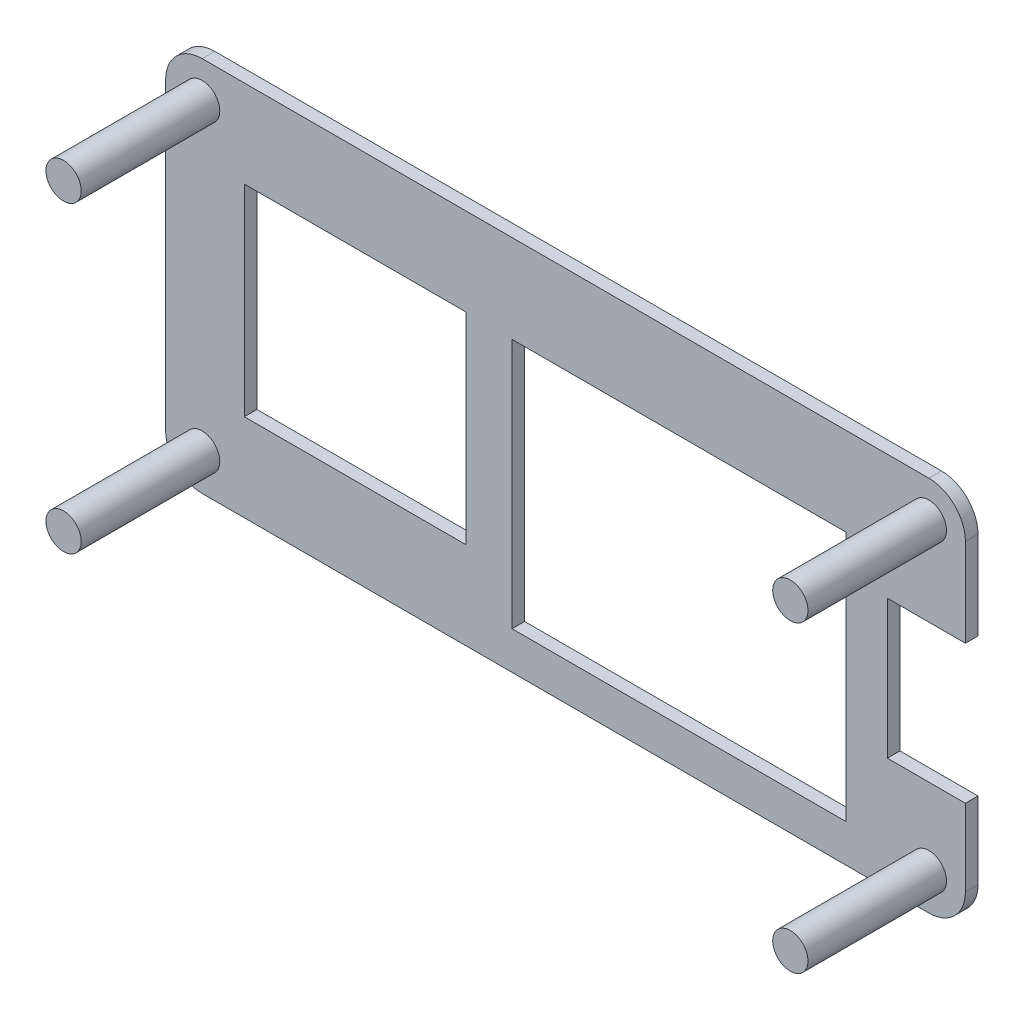
ISO-10303-21;
HEADER;
FILE_DESCRIPTION(('STEP AP214'),'2;1');
FILE_NAME('part.step','',(''),(''),'','','');
FILE_SCHEMA(('AUTOMOTIVE_DESIGN { 1 0 10303 214 1 1 1 1 }'));
ENDSEC;
DATA;
#1=APPLICATION_CONTEXT('core data for automotive mechanical design processes');
#2=APPLICATION_PROTOCOL_DEFINITION('international standard','automotive_design',2000,#1);
#3=PRODUCT_CONTEXT('',#1,'mechanical');
#4=PRODUCT('Part','Part','',(#3));
#5=PRODUCT_RELATED_PRODUCT_CATEGORY('part','',(#4));
#6=PRODUCT_DEFINITION_FORMATION('','',#4);
#7=PRODUCT_DEFINITION_CONTEXT('part definition',#1,'design');
#8=PRODUCT_DEFINITION('design','',#6,#7);
#9=PRODUCT_DEFINITION_SHAPE('','',#8);
#10=(LENGTH_UNIT() NAMED_UNIT(*) SI_UNIT(.MILLI.,.METRE.));
#11=(NAMED_UNIT(*) PLANE_ANGLE_UNIT() SI_UNIT($,.RADIAN.));
#12=(NAMED_UNIT(*) SI_UNIT($,.STERADIAN.) SOLID_ANGLE_UNIT());
#13=UNCERTAINTY_MEASURE_WITH_UNIT(LENGTH_MEASURE(1.E-05),#10,'distance_accuracy_value','');
#14=(GEOMETRIC_REPRESENTATION_CONTEXT(3) GLOBAL_UNCERTAINTY_ASSIGNED_CONTEXT((#13)) GLOBAL_UNIT_ASSIGNED_CONTEXT((#10,
#11,#12)) REPRESENTATION_CONTEXT('',''));
#15=CARTESIAN_POINT('',(0.,0.,0.));
#16=DIRECTION('',(0.,0.,1.));
#17=DIRECTION('',(1.,0.,0.));
#18=AXIS2_PLACEMENT_3D('',#15,#16,#17);
#19=CARTESIAN_POINT('',(60.6,0.,1.));
#20=DIRECTION('',(-1.,0.,0.));
#21=DIRECTION('',(0.,0.,1.));
#22=AXIS2_PLACEMENT_3D('',#19,#20,#21);
#23=PLANE('',#22);
#24=DIRECTION('',(0.,1.,0.));
#25=VECTOR('',#24,1.);
#26=CARTESIAN_POINT('',(60.6,0.,1.));
#27=LINE('',#26,#25);
#28=CARTESIAN_POINT('',(60.6,17.1,1.));
#29=VERTEX_POINT('',#28);
#30=CARTESIAN_POINT('',(60.6,24.1,1.));
#31=VERTEX_POINT('',#30);
#32=EDGE_CURVE('E356',#29,#31,#27,.T.);
#33=ORIENTED_EDGE('',*,*,#32,.F.);
#34=DIRECTION('',(0.,0.,1.));
#35=VECTOR('',#34,1.);
#36=CARTESIAN_POINT('',(60.6,17.1,0.));
#37=LINE('',#36,#35);
#38=CARTESIAN_POINT('',(60.6,17.1,0.));
#39=VERTEX_POINT('',#38);
#40=EDGE_CURVE('E256',#39,#29,#37,.T.);
#41=ORIENTED_EDGE('',*,*,#40,.F.);
#42=DIRECTION('',(0.,1.,0.));
#43=VECTOR('',#42,1.);
#44=CARTESIAN_POINT('',(60.6,0.,0.));
#45=LINE('',#44,#43);
#46=CARTESIAN_POINT('',(60.6,24.1,0.));
#47=VERTEX_POINT('',#46);
#48=EDGE_CURVE('E386',#39,#47,#45,.T.);
#49=ORIENTED_EDGE('',*,*,#48,.T.);
#50=DIRECTION('',(0.,0.,-1.));
#51=VECTOR('',#50,1.);
#52=CARTESIAN_POINT('',(60.6,24.1,1.));
#53=LINE('',#52,#51);
#54=EDGE_CURVE('E403',#31,#47,#53,.T.);
#55=ORIENTED_EDGE('',*,*,#54,.F.);
#56=EDGE_LOOP('',(#33,#41,#49,#55));
#57=FACE_BOUND('',#56,.T.);
#58=ADVANCED_FACE('F39',(#57),#23,.F.);
#59=CARTESIAN_POINT('',(0.,24.1000000000001,1.));
#60=DIRECTION('',(0.,0.,-1.));
#61=DIRECTION('',(-1.,0.,0.));
#62=AXIS2_PLACEMENT_3D('',#59,#60,#61);
#63=CYLINDRICAL_SURFACE('',#62,2.89999999999992);
#64=CARTESIAN_POINT('',(0.,24.1000000000001,0.));
#65=DIRECTION('',(0.,0.,1.));
#66=DIRECTION('',(1.,0.,0.));
#67=AXIS2_PLACEMENT_3D('',#64,#65,#66);
#68=CIRCLE('',#67,2.89999999999992);
#69=CARTESIAN_POINT('',(0.,27.,0.));
#70=VERTEX_POINT('',#69);
#71=CARTESIAN_POINT('',(-2.9,24.1,0.));
#72=VERTEX_POINT('',#71);
#73=EDGE_CURVE('E337',#70,#72,#68,.T.);
#74=ORIENTED_EDGE('',*,*,#73,.T.);
#75=DIRECTION('',(0.,0.,-1.));
#76=VECTOR('',#75,1.);
#77=CARTESIAN_POINT('',(-2.9,24.1,1.));
#78=LINE('',#77,#76);
#79=CARTESIAN_POINT('',(-2.9,24.1,1.));
#80=VERTEX_POINT('',#79);
#81=EDGE_CURVE('E11',#80,#72,#78,.T.);
#82=ORIENTED_EDGE('',*,*,#81,.F.);
#83=CARTESIAN_POINT('',(0.,24.1000000000001,1.));
#84=DIRECTION('',(0.,0.,1.));
#85=DIRECTION('',(1.,0.,0.));
#86=AXIS2_PLACEMENT_3D('',#83,#84,#85);
#87=CIRCLE('',#86,2.89999999999992);
#88=CARTESIAN_POINT('',(0.,27.,1.));
#89=VERTEX_POINT('',#88);
#90=EDGE_CURVE('E338',#89,#80,#87,.T.);
#91=ORIENTED_EDGE('',*,*,#90,.F.);
#92=DIRECTION('',(0.,0.,-1.));
#93=VECTOR('',#92,1.);
#94=CARTESIAN_POINT('',(0.,27.,1.));
#95=LINE('',#94,#93);
#96=EDGE_CURVE('E368',#89,#70,#95,.T.);
#97=ORIENTED_EDGE('',*,*,#96,.T.);
#98=EDGE_LOOP('',(#74,#82,#91,#97));
#99=FACE_BOUND('',#98,.T.);
#100=ADVANCED_FACE('F41',(#99),#63,.T.);
#101=CARTESIAN_POINT('',(-2.9,0.,1.));
#102=DIRECTION('',(-1.,0.,0.));
#103=DIRECTION('',(0.,0.,1.));
#104=AXIS2_PLACEMENT_3D('',#101,#102,#103);
#105=PLANE('',#104);
#106=DIRECTION('',(0.,1.,0.));
#107=VECTOR('',#106,1.);
#108=CARTESIAN_POINT('',(-2.9,0.,0.));
#109=LINE('',#108,#107);
#110=CARTESIAN_POINT('',(-2.9,0.,0.));
#111=VERTEX_POINT('',#110);
#112=EDGE_CURVE('E372',#111,#72,#109,.T.);
#113=ORIENTED_EDGE('',*,*,#112,.F.);
#114=DIRECTION('',(0.,0.,-1.));
#115=VECTOR('',#114,1.);
#116=CARTESIAN_POINT('',(-2.9,0.,1.));
#117=LINE('',#116,#115);
#118=CARTESIAN_POINT('',(-2.9,0.,1.));
#119=VERTEX_POINT('',#118);
#120=EDGE_CURVE('E48',#119,#111,#117,.T.);
#121=ORIENTED_EDGE('',*,*,#120,.F.);
#122=DIRECTION('',(0.,1.,0.));
#123=VECTOR('',#122,1.);
#124=CARTESIAN_POINT('',(-2.9,0.,1.));
#125=LINE('',#124,#123);
#126=EDGE_CURVE('E341',#119,#80,#125,.T.);
#127=ORIENTED_EDGE('',*,*,#126,.T.);
#128=ORIENTED_EDGE('',*,*,#81,.T.);
#129=EDGE_LOOP('',(#113,#121,#127,#128));
#130=FACE_BOUND('',#129,.T.);
#131=ADVANCED_FACE('F425',(#130),#105,.T.);
#132=CARTESIAN_POINT('',(0.,0.,1.));
#133=DIRECTION('',(0.,0.,-1.));
#134=DIRECTION('',(-1.,0.,0.));
#135=AXIS2_PLACEMENT_3D('',#132,#133,#134);
#136=CYLINDRICAL_SURFACE('',#135,2.9);
#137=CARTESIAN_POINT('',(0.,0.,0.));
#138=DIRECTION('',(0.,0.,-1.));
#139=DIRECTION('',(-1.,0.,0.));
#140=AXIS2_PLACEMENT_3D('',#137,#138,#139);
#141=CIRCLE('',#140,2.9);
#142=CARTESIAN_POINT('',(0.,-2.9,0.));
#143=VERTEX_POINT('',#142);
#144=EDGE_CURVE('E376',#143,#111,#141,.T.);
#145=ORIENTED_EDGE('',*,*,#144,.F.);
#146=DIRECTION('',(0.,0.,-1.));
#147=VECTOR('',#146,1.);
#148=CARTESIAN_POINT('',(0.,-2.9,1.));
#149=LINE('',#148,#147);
#150=CARTESIAN_POINT('',(0.,-2.9,1.));
#151=VERTEX_POINT('',#150);
#152=EDGE_CURVE('E415',#151,#143,#149,.T.);
#153=ORIENTED_EDGE('',*,*,#152,.F.);
#154=CARTESIAN_POINT('',(0.,0.,1.));
#155=DIRECTION('',(0.,0.,-1.));
#156=DIRECTION('',(-1.,0.,0.));
#157=AXIS2_PLACEMENT_3D('',#154,#155,#156);
#158=CIRCLE('',#157,2.9);
#159=EDGE_CURVE('E346',#151,#119,#158,.T.);
#160=ORIENTED_EDGE('',*,*,#159,.T.);
#161=ORIENTED_EDGE('',*,*,#120,.T.);
#162=EDGE_LOOP('',(#145,#153,#160,#161));
#163=FACE_BOUND('',#162,.T.);
#164=ADVANCED_FACE('F421',(#163),#136,.T.);
#165=CARTESIAN_POINT('',(0.,-2.9,1.));
#166=DIRECTION('',(0.,1.,0.));
#167=DIRECTION('',(0.,0.,1.));
#168=AXIS2_PLACEMENT_3D('',#165,#166,#167);
#169=PLANE('',#168);
#170=DIRECTION('',(1.,0.,0.));
#171=VECTOR('',#170,1.);
#172=CARTESIAN_POINT('',(0.,-2.9,0.));
#173=LINE('',#172,#171);
#174=CARTESIAN_POINT('',(57.7,-2.9,0.));
#175=VERTEX_POINT('',#174);
#176=EDGE_CURVE('E380',#143,#175,#173,.T.);
#177=ORIENTED_EDGE('',*,*,#176,.T.);
#178=DIRECTION('',(0.,0.,-1.));
#179=VECTOR('',#178,1.);
#180=CARTESIAN_POINT('',(57.7,-2.9,1.));
#181=LINE('',#180,#179);
#182=CARTESIAN_POINT('',(57.7,-2.9,1.));
#183=VERTEX_POINT('',#182);
#184=EDGE_CURVE('E411',#183,#175,#181,.T.);
#185=ORIENTED_EDGE('',*,*,#184,.F.);
#186=DIRECTION('',(1.,0.,0.));
#187=VECTOR('',#186,1.);
#188=CARTESIAN_POINT('',(0.,-2.9,1.));
#189=LINE('',#188,#187);
#190=EDGE_CURVE('E350',#151,#183,#189,.T.);
#191=ORIENTED_EDGE('',*,*,#190,.F.);
#192=ORIENTED_EDGE('',*,*,#152,.T.);
#193=EDGE_LOOP('',(#177,#185,#191,#192));
#194=FACE_BOUND('',#193,.T.);
#195=ADVANCED_FACE('F435',(#194),#169,.F.);
#196=CARTESIAN_POINT('',(57.7,0.,1.));
#197=DIRECTION('',(0.,0.,-1.));
#198=DIRECTION('',(-1.,0.,0.));
#199=AXIS2_PLACEMENT_3D('',#196,#197,#198);
#200=CYLINDRICAL_SURFACE('',#199,2.9);
#201=CARTESIAN_POINT('',(57.7,0.,0.));
#202=DIRECTION('',(0.,0.,1.));
#203=DIRECTION('',(1.,0.,0.));
#204=AXIS2_PLACEMENT_3D('',#201,#202,#203);
#205=CIRCLE('',#204,2.9);
#206=CARTESIAN_POINT('',(60.6,0.,0.));
#207=VERTEX_POINT('',#206);
#208=EDGE_CURVE('E383',#175,#207,#205,.T.);
#209=ORIENTED_EDGE('',*,*,#208,.T.);
#210=DIRECTION('',(0.,0.,-1.));
#211=VECTOR('',#210,1.);
#212=CARTESIAN_POINT('',(60.6,0.,1.));
#213=LINE('',#212,#211);
#214=CARTESIAN_POINT('',(60.6,0.,1.));
#215=VERTEX_POINT('',#214);
#216=EDGE_CURVE('E407',#215,#207,#213,.T.);
#217=ORIENTED_EDGE('',*,*,#216,.F.);
#218=CARTESIAN_POINT('',(57.7,0.,1.));
#219=DIRECTION('',(0.,0.,1.));
#220=DIRECTION('',(1.,0.,0.));
#221=AXIS2_PLACEMENT_3D('',#218,#219,#220);
#222=CIRCLE('',#221,2.9);
#223=EDGE_CURVE('E353',#183,#215,#222,.T.);
#224=ORIENTED_EDGE('',*,*,#223,.F.);
#225=ORIENTED_EDGE('',*,*,#184,.T.);
#226=EDGE_LOOP('',(#209,#217,#224,#225));
#227=FACE_BOUND('',#226,.T.);
#228=ADVANCED_FACE('F439',(#227),#200,.T.);
#229=CARTESIAN_POINT('',(60.6,6.1,0.));
#230=VERTEX_POINT('',#229);
#231=EDGE_CURVE('E387',#207,#230,#45,.T.);
#232=ORIENTED_EDGE('',*,*,#231,.T.);
#233=DIRECTION('',(0.,0.,1.));
#234=VECTOR('',#233,1.);
#235=CARTESIAN_POINT('',(60.6,6.1,0.));
#236=LINE('',#235,#234);
#237=CARTESIAN_POINT('',(60.6,6.1,1.));
#238=VERTEX_POINT('',#237);
#239=EDGE_CURVE('E259',#230,#238,#236,.T.);
#240=ORIENTED_EDGE('',*,*,#239,.T.);
#241=EDGE_CURVE('E357',#215,#238,#27,.T.);
#242=ORIENTED_EDGE('',*,*,#241,.F.);
#243=ORIENTED_EDGE('',*,*,#216,.T.);
#244=EDGE_LOOP('',(#232,#240,#242,#243));
#245=FACE_BOUND('',#244,.T.);
#246=ADVANCED_FACE('F467',(#245),#23,.F.);
#247=CARTESIAN_POINT('',(57.7,24.1,1.));
#248=DIRECTION('',(0.,0.,-1.));
#249=DIRECTION('',(-1.,0.,0.));
#250=AXIS2_PLACEMENT_3D('',#247,#248,#249);
#251=CYLINDRICAL_SURFACE('',#250,2.9);
#252=CARTESIAN_POINT('',(57.7,24.1,0.));
#253=DIRECTION('',(0.,0.,1.));
#254=DIRECTION('',(1.,0.,0.));
#255=AXIS2_PLACEMENT_3D('',#252,#253,#254);
#256=CIRCLE('',#255,2.9);
#257=CARTESIAN_POINT('',(57.6999999999999,27.,0.));
#258=VERTEX_POINT('',#257);
#259=EDGE_CURVE('E391',#47,#258,#256,.T.);
#260=ORIENTED_EDGE('',*,*,#259,.T.);
#261=DIRECTION('',(0.,0.,-1.));
#262=VECTOR('',#261,1.);
#263=CARTESIAN_POINT('',(57.6999999999999,27.,1.));
#264=LINE('',#263,#262);
#265=CARTESIAN_POINT('',(57.6999999999999,27.,1.));
#266=VERTEX_POINT('',#265);
#267=EDGE_CURVE('E400',#266,#258,#264,.T.);
#268=ORIENTED_EDGE('',*,*,#267,.F.);
#269=CARTESIAN_POINT('',(57.7,24.1,1.));
#270=DIRECTION('',(0.,0.,1.));
#271=DIRECTION('',(1.,0.,0.));
#272=AXIS2_PLACEMENT_3D('',#269,#270,#271);
#273=CIRCLE('',#272,2.9);
#274=EDGE_CURVE('E361',#31,#266,#273,.T.);
#275=ORIENTED_EDGE('',*,*,#274,.F.);
#276=ORIENTED_EDGE('',*,*,#54,.T.);
#277=EDGE_LOOP('',(#260,#268,#275,#276));
#278=FACE_BOUND('',#277,.T.);
#279=ADVANCED_FACE('F457',(#278),#251,.T.);
#280=CARTESIAN_POINT('',(0.,27.,1.));
#281=DIRECTION('',(0.,1.,0.));
#282=DIRECTION('',(0.,0.,1.));
#283=AXIS2_PLACEMENT_3D('',#280,#281,#282);
#284=PLANE('',#283);
#285=DIRECTION('',(1.,0.,0.));
#286=VECTOR('',#285,1.);
#287=CARTESIAN_POINT('',(0.,27.,0.));
#288=LINE('',#287,#286);
#289=EDGE_CURVE('E342',#70,#258,#288,.T.);
#290=ORIENTED_EDGE('',*,*,#289,.F.);
#291=ORIENTED_EDGE('',*,*,#96,.F.);
#292=DIRECTION('',(1.,0.,0.));
#293=VECTOR('',#292,1.);
#294=CARTESIAN_POINT('',(0.,27.,1.));
#295=LINE('',#294,#293);
#296=EDGE_CURVE('E364',#89,#266,#295,.T.);
#297=ORIENTED_EDGE('',*,*,#296,.T.);
#298=ORIENTED_EDGE('',*,*,#267,.T.);
#299=EDGE_LOOP('',(#290,#291,#297,#298));
#300=FACE_BOUND('',#299,.T.);
#301=ADVANCED_FACE('F453',(#300),#284,.T.);
#302=CARTESIAN_POINT('',(0.,24.1000000000001,1.));
#303=DIRECTION('',(0.,0.,1.));
#304=DIRECTION('',(1.,0.,0.));
#305=AXIS2_PLACEMENT_3D('',#302,#303,#304);
#306=PLANE('',#305);
#307=DIRECTION('',(-1.,0.,0.));
#308=VECTOR('',#307,1.);
#309=CARTESIAN_POINT('',(3.35,20.05,1.));
#310=LINE('',#309,#308);
#311=CARTESIAN_POINT('',(20.95,20.05,1.));
#312=VERTEX_POINT('',#311);
#313=CARTESIAN_POINT('',(3.35,20.05,1.));
#314=VERTEX_POINT('',#313);
#315=EDGE_CURVE('E55',#312,#314,#310,.T.);
#316=ORIENTED_EDGE('',*,*,#315,.F.);
#317=DIRECTION('',(0.,1.,0.));
#318=VECTOR('',#317,1.);
#319=CARTESIAN_POINT('',(20.95,4.05,1.));
#320=LINE('',#319,#318);
#321=CARTESIAN_POINT('',(20.95,4.05,1.));
#322=VERTEX_POINT('',#321);
#323=EDGE_CURVE('E200',#322,#312,#320,.T.);
#324=ORIENTED_EDGE('',*,*,#323,.F.);
#325=DIRECTION('',(1.,0.,0.));
#326=VECTOR('',#325,1.);
#327=CARTESIAN_POINT('',(3.35,4.05,1.));
#328=LINE('',#327,#326);
#329=CARTESIAN_POINT('',(3.35,4.05,1.));
#330=VERTEX_POINT('',#329);
#331=EDGE_CURVE('E204',#330,#322,#328,.T.);
#332=ORIENTED_EDGE('',*,*,#331,.F.);
#333=DIRECTION('',(0.,-1.,0.));
#334=VECTOR('',#333,1.);
#335=CARTESIAN_POINT('',(3.35,4.05,1.));
#336=LINE('',#335,#334);
#337=EDGE_CURVE('E213',#314,#330,#336,.T.);
#338=ORIENTED_EDGE('',*,*,#337,.F.);
#339=EDGE_LOOP('',(#316,#324,#332,#338));
#340=FACE_BOUND('',#339,.T.);
#341=DIRECTION('',(-1.,0.,0.));
#342=VECTOR('',#341,1.);
#343=CARTESIAN_POINT('',(54.4,17.1,1.));
#344=LINE('',#343,#342);
#345=CARTESIAN_POINT('',(54.4,17.1,1.));
#346=VERTEX_POINT('',#345);
#347=EDGE_CURVE('E234',#29,#346,#344,.T.);
#348=ORIENTED_EDGE('',*,*,#347,.F.);
#349=ORIENTED_EDGE('',*,*,#32,.T.);
#350=ORIENTED_EDGE('',*,*,#274,.T.);
#351=ORIENTED_EDGE('',*,*,#296,.F.);
#352=ORIENTED_EDGE('',*,*,#90,.T.);
#353=ORIENTED_EDGE('',*,*,#126,.F.);
#354=ORIENTED_EDGE('',*,*,#159,.F.);
#355=ORIENTED_EDGE('',*,*,#190,.T.);
#356=ORIENTED_EDGE('',*,*,#223,.T.);
#357=ORIENTED_EDGE('',*,*,#241,.T.);
#358=DIRECTION('',(1.,0.,0.));
#359=VECTOR('',#358,1.);
#360=CARTESIAN_POINT('',(54.4,6.1,1.));
#361=LINE('',#360,#359);
#362=CARTESIAN_POINT('',(54.4,6.1,1.));
#363=VERTEX_POINT('',#362);
#364=EDGE_CURVE('E247',#363,#238,#361,.T.);
#365=ORIENTED_EDGE('',*,*,#364,.F.);
#366=DIRECTION('',(0.,-1.,0.));
#367=VECTOR('',#366,1.);
#368=CARTESIAN_POINT('',(54.4,6.1,1.));
#369=LINE('',#368,#367);
#370=EDGE_CURVE('E243',#346,#363,#369,.T.);
#371=ORIENTED_EDGE('',*,*,#370,.F.);
#372=EDGE_LOOP('',(#348,#349,#350,#351,#352,#353,#354,#355,#356,#357,#365,#371));
#373=FACE_BOUND('',#372,.T.);
#374=DIRECTION('',(0.,1.,0.));
#375=VECTOR('',#374,1.);
#376=CARTESIAN_POINT('',(51.1,20.,1.));
#377=LINE('',#376,#375);
#378=CARTESIAN_POINT('',(51.1,0.1,1.));
#379=VERTEX_POINT('',#378);
#380=CARTESIAN_POINT('',(51.1,20.,1.));
#381=VERTEX_POINT('',#380);
#382=EDGE_CURVE('E63',#379,#381,#377,.T.);
#383=ORIENTED_EDGE('',*,*,#382,.F.);
#384=DIRECTION('',(1.,0.,0.));
#385=VECTOR('',#384,1.);
#386=CARTESIAN_POINT('',(51.1,0.1,1.));
#387=LINE('',#386,#385);
#388=CARTESIAN_POINT('',(24.6,0.099999999999997,1.));
#389=VERTEX_POINT('',#388);
#390=EDGE_CURVE('E270',#389,#379,#387,.T.);
#391=ORIENTED_EDGE('',*,*,#390,.F.);
#392=DIRECTION('',(0.,-1.,0.));
#393=VECTOR('',#392,1.);
#394=CARTESIAN_POINT('',(24.6,20.,1.));
#395=LINE('',#394,#393);
#396=CARTESIAN_POINT('',(24.6,20.,1.));
#397=VERTEX_POINT('',#396);
#398=EDGE_CURVE('E289',#397,#389,#395,.T.);
#399=ORIENTED_EDGE('',*,*,#398,.F.);
#400=DIRECTION('',(-1.,0.,0.));
#401=VECTOR('',#400,1.);
#402=CARTESIAN_POINT('',(51.1,20.,1.));
#403=LINE('',#402,#401);
#404=EDGE_CURVE('E285',#381,#397,#403,.T.);
#405=ORIENTED_EDGE('',*,*,#404,.F.);
#406=EDGE_LOOP('',(#383,#391,#399,#405));
#407=FACE_BOUND('',#406,.T.);
#408=CARTESIAN_POINT('',(57.6999999999999,24.1,1.));
#409=DIRECTION('',(0.,0.,1.));
#410=DIRECTION('',(1.,0.,0.));
#411=AXIS2_PLACEMENT_3D('',#408,#409,#410);
#412=CIRCLE('',#411,1.4);
#413=CARTESIAN_POINT('',(59.0999999999999,24.1,1.));
#414=VERTEX_POINT('',#413);
#415=EDGE_CURVE('E309',#414,#414,#412,.F.);
#416=ORIENTED_EDGE('',*,*,#415,.T.);
#417=EDGE_LOOP('',(#416));
#418=FACE_BOUND('',#417,.T.);
#419=CARTESIAN_POINT('',(0.,0.,1.));
#420=DIRECTION('',(0.,0.,1.));
#421=DIRECTION('',(1.,0.,0.));
#422=AXIS2_PLACEMENT_3D('',#419,#420,#421);
#423=CIRCLE('',#422,1.4);
#424=CARTESIAN_POINT('',(1.4,0.,1.));
#425=VERTEX_POINT('',#424);
#426=EDGE_CURVE('E317',#425,#425,#423,.F.);
#427=ORIENTED_EDGE('',*,*,#426,.T.);
#428=EDGE_LOOP('',(#427));
#429=FACE_BOUND('',#428,.T.);
#430=CARTESIAN_POINT('',(0.,24.1,1.));
#431=DIRECTION('',(0.,0.,1.));
#432=DIRECTION('',(1.,0.,0.));
#433=AXIS2_PLACEMENT_3D('',#430,#431,#432);
#434=CIRCLE('',#433,1.4);
#435=CARTESIAN_POINT('',(1.39999999999992,24.1,1.));
#436=VERTEX_POINT('',#435);
#437=EDGE_CURVE('E325',#436,#436,#434,.F.);
#438=ORIENTED_EDGE('',*,*,#437,.T.);
#439=EDGE_LOOP('',(#438));
#440=FACE_BOUND('',#439,.T.);
#441=CARTESIAN_POINT('',(57.7,0.,1.));
#442=DIRECTION('',(0.,0.,1.));
#443=DIRECTION('',(1.,0.,0.));
#444=AXIS2_PLACEMENT_3D('',#441,#442,#443);
#445=CIRCLE('',#444,1.4);
#446=CARTESIAN_POINT('',(59.1,0.,1.));
#447=VERTEX_POINT('',#446);
#448=EDGE_CURVE('E333',#447,#447,#445,.F.);
#449=ORIENTED_EDGE('',*,*,#448,.T.);
#450=EDGE_LOOP('',(#449));
#451=FACE_BOUND('',#450,.T.);
#452=ADVANCED_FACE('F444',(#340,#373,#407,#418,#429,#440,#451),#306,.T.);
#453=CARTESIAN_POINT('',(0.,24.1000000000001,0.));
#454=DIRECTION('',(0.,0.,1.));
#455=DIRECTION('',(1.,0.,0.));
#456=AXIS2_PLACEMENT_3D('',#453,#454,#455);
#457=PLANE('',#456);
#458=DIRECTION('',(0.,1.,0.));
#459=VECTOR('',#458,1.);
#460=CARTESIAN_POINT('',(20.95,4.05,0.));
#461=LINE('',#460,#459);
#462=CARTESIAN_POINT('',(20.95,4.05,0.));
#463=VERTEX_POINT('',#462);
#464=CARTESIAN_POINT('',(20.95,20.05,0.));
#465=VERTEX_POINT('',#464);
#466=EDGE_CURVE('E185',#463,#465,#461,.T.);
#467=ORIENTED_EDGE('',*,*,#466,.T.);
#468=DIRECTION('',(-1.,0.,0.));
#469=VECTOR('',#468,1.);
#470=CARTESIAN_POINT('',(3.35,20.05,0.));
#471=LINE('',#470,#469);
#472=CARTESIAN_POINT('',(3.35,20.05,0.));
#473=VERTEX_POINT('',#472);
#474=EDGE_CURVE('E178',#465,#473,#471,.T.);
#475=ORIENTED_EDGE('',*,*,#474,.T.);
#476=DIRECTION('',(0.,-1.,0.));
#477=VECTOR('',#476,1.);
#478=CARTESIAN_POINT('',(3.35,4.05,0.));
#479=LINE('',#478,#477);
#480=CARTESIAN_POINT('',(3.35,4.05,0.));
#481=VERTEX_POINT('',#480);
#482=EDGE_CURVE('E189',#473,#481,#479,.T.);
#483=ORIENTED_EDGE('',*,*,#482,.T.);
#484=DIRECTION('',(1.,0.,0.));
#485=VECTOR('',#484,1.);
#486=CARTESIAN_POINT('',(3.35,4.05,0.));
#487=LINE('',#486,#485);
#488=EDGE_CURVE('E194',#481,#463,#487,.T.);
#489=ORIENTED_EDGE('',*,*,#488,.T.);
#490=EDGE_LOOP('',(#467,#475,#483,#489));
#491=FACE_BOUND('',#490,.T.);
#492=DIRECTION('',(1.,0.,0.));
#493=VECTOR('',#492,1.);
#494=CARTESIAN_POINT('',(51.1,0.1,0.));
#495=LINE('',#494,#493);
#496=CARTESIAN_POINT('',(24.6,0.099999999999997,0.));
#497=VERTEX_POINT('',#496);
#498=CARTESIAN_POINT('',(51.1,0.1,0.));
#499=VERTEX_POINT('',#498);
#500=EDGE_CURVE('E278',#497,#499,#495,.T.);
#501=ORIENTED_EDGE('',*,*,#500,.T.);
#502=DIRECTION('',(0.,1.,0.));
#503=VECTOR('',#502,1.);
#504=CARTESIAN_POINT('',(51.1,20.,0.));
#505=LINE('',#504,#503);
#506=CARTESIAN_POINT('',(51.1,20.,0.));
#507=VERTEX_POINT('',#506);
#508=EDGE_CURVE('E265',#499,#507,#505,.T.);
#509=ORIENTED_EDGE('',*,*,#508,.T.);
#510=DIRECTION('',(-1.,0.,0.));
#511=VECTOR('',#510,1.);
#512=CARTESIAN_POINT('',(51.1,20.,0.));
#513=LINE('',#512,#511);
#514=CARTESIAN_POINT('',(24.6,20.,0.));
#515=VERTEX_POINT('',#514);
#516=EDGE_CURVE('E269',#507,#515,#513,.T.);
#517=ORIENTED_EDGE('',*,*,#516,.T.);
#518=DIRECTION('',(0.,-1.,0.));
#519=VECTOR('',#518,1.);
#520=CARTESIAN_POINT('',(24.6,20.,0.));
#521=LINE('',#520,#519);
#522=EDGE_CURVE('E274',#515,#497,#521,.T.);
#523=ORIENTED_EDGE('',*,*,#522,.T.);
#524=EDGE_LOOP('',(#501,#509,#517,#523));
#525=FACE_BOUND('',#524,.T.);
#526=ORIENTED_EDGE('',*,*,#48,.F.);
#527=DIRECTION('',(-1.,0.,0.));
#528=VECTOR('',#527,1.);
#529=CARTESIAN_POINT('',(54.4,17.1,0.));
#530=LINE('',#529,#528);
#531=CARTESIAN_POINT('',(54.4,17.1,0.));
#532=VERTEX_POINT('',#531);
#533=EDGE_CURVE('E238',#39,#532,#530,.T.);
#534=ORIENTED_EDGE('',*,*,#533,.T.);
#535=DIRECTION('',(0.,-1.,0.));
#536=VECTOR('',#535,1.);
#537=CARTESIAN_POINT('',(54.4,6.1,0.));
#538=LINE('',#537,#536);
#539=CARTESIAN_POINT('',(54.4,6.1,0.));
#540=VERTEX_POINT('',#539);
#541=EDGE_CURVE('E229',#532,#540,#538,.T.);
#542=ORIENTED_EDGE('',*,*,#541,.T.);
#543=DIRECTION('',(1.,0.,0.));
#544=VECTOR('',#543,1.);
#545=CARTESIAN_POINT('',(54.4,6.1,0.));
#546=LINE('',#545,#544);
#547=EDGE_CURVE('E233',#540,#230,#546,.T.);
#548=ORIENTED_EDGE('',*,*,#547,.T.);
#549=ORIENTED_EDGE('',*,*,#231,.F.);
#550=ORIENTED_EDGE('',*,*,#208,.F.);
#551=ORIENTED_EDGE('',*,*,#176,.F.);
#552=ORIENTED_EDGE('',*,*,#144,.T.);
#553=ORIENTED_EDGE('',*,*,#112,.T.);
#554=ORIENTED_EDGE('',*,*,#73,.F.);
#555=ORIENTED_EDGE('',*,*,#289,.T.);
#556=ORIENTED_EDGE('',*,*,#259,.F.);
#557=EDGE_LOOP('',(#526,#534,#542,#548,#549,#550,#551,#552,#553,#554,#555,#556));
#558=FACE_BOUND('',#557,.T.);
#559=ADVANCED_FACE('F196',(#491,#525,#558),#457,.F.);
#560=CARTESIAN_POINT('',(57.7,0.,12.));
#561=DIRECTION('',(0.,0.,-1.));
#562=DIRECTION('',(-1.,0.,0.));
#563=AXIS2_PLACEMENT_3D('',#560,#561,#562);
#564=CYLINDRICAL_SURFACE('',#563,1.4);
#565=ORIENTED_EDGE('',*,*,#448,.F.);
#566=EDGE_LOOP('',(#565));
#567=FACE_BOUND('',#566,.T.);
#568=CARTESIAN_POINT('',(57.7,0.,12.));
#569=DIRECTION('',(0.,0.,1.));
#570=DIRECTION('',(1.,0.,0.));
#571=AXIS2_PLACEMENT_3D('',#568,#569,#570);
#572=CIRCLE('',#571,1.4);
#573=CARTESIAN_POINT('',(59.1,0.,12.));
#574=VERTEX_POINT('',#573);
#575=EDGE_CURVE('E329',#574,#574,#572,.T.);
#576=ORIENTED_EDGE('',*,*,#575,.F.);
#577=EDGE_LOOP('',(#576));
#578=FACE_BOUND('',#577,.T.);
#579=ADVANCED_FACE('F540',(#567,#578),#564,.T.);
#580=CARTESIAN_POINT('',(57.7,0.,12.));
#581=DIRECTION('',(0.,0.,1.));
#582=DIRECTION('',(1.,0.,0.));
#583=AXIS2_PLACEMENT_3D('',#580,#581,#582);
#584=PLANE('',#583);
#585=ORIENTED_EDGE('',*,*,#575,.T.);
#586=EDGE_LOOP('',(#585));
#587=FACE_BOUND('',#586,.T.);
#588=ADVANCED_FACE('F536',(#587),#584,.T.);
#589=CARTESIAN_POINT('',(0.,24.1,12.));
#590=DIRECTION('',(0.,0.,-1.));
#591=DIRECTION('',(-1.,0.,0.));
#592=AXIS2_PLACEMENT_3D('',#589,#590,#591);
#593=CYLINDRICAL_SURFACE('',#592,1.4);
#594=ORIENTED_EDGE('',*,*,#437,.F.);
#595=EDGE_LOOP('',(#594));
#596=FACE_BOUND('',#595,.T.);
#597=CARTESIAN_POINT('',(0.,24.1,12.));
#598=DIRECTION('',(0.,0.,1.));
#599=DIRECTION('',(1.,0.,0.));
#600=AXIS2_PLACEMENT_3D('',#597,#598,#599);
#601=CIRCLE('',#600,1.4);
#602=CARTESIAN_POINT('',(1.39999999999992,24.1,12.));
#603=VERTEX_POINT('',#602);
#604=EDGE_CURVE('E321',#603,#603,#601,.T.);
#605=ORIENTED_EDGE('',*,*,#604,.F.);
#606=EDGE_LOOP('',(#605));
#607=FACE_BOUND('',#606,.T.);
#608=ADVANCED_FACE('F532',(#596,#607),#593,.T.);
#609=CARTESIAN_POINT('',(0.,24.1,12.));
#610=DIRECTION('',(0.,0.,1.));
#611=DIRECTION('',(1.,0.,0.));
#612=AXIS2_PLACEMENT_3D('',#609,#610,#611);
#613=PLANE('',#612);
#614=ORIENTED_EDGE('',*,*,#604,.T.);
#615=EDGE_LOOP('',(#614));
#616=FACE_BOUND('',#615,.T.);
#617=ADVANCED_FACE('F528',(#616),#613,.T.);
#618=CARTESIAN_POINT('',(0.,0.,12.));
#619=DIRECTION('',(0.,0.,-1.));
#620=DIRECTION('',(-1.,0.,0.));
#621=AXIS2_PLACEMENT_3D('',#618,#619,#620);
#622=CYLINDRICAL_SURFACE('',#621,1.4);
#623=ORIENTED_EDGE('',*,*,#426,.F.);
#624=EDGE_LOOP('',(#623));
#625=FACE_BOUND('',#624,.T.);
#626=CARTESIAN_POINT('',(0.,0.,12.));
#627=DIRECTION('',(0.,0.,1.));
#628=DIRECTION('',(1.,0.,0.));
#629=AXIS2_PLACEMENT_3D('',#626,#627,#628);
#630=CIRCLE('',#629,1.4);
#631=CARTESIAN_POINT('',(1.4,0.,12.));
#632=VERTEX_POINT('',#631);
#633=EDGE_CURVE('E313',#632,#632,#630,.T.);
#634=ORIENTED_EDGE('',*,*,#633,.F.);
#635=EDGE_LOOP('',(#634));
#636=FACE_BOUND('',#635,.T.);
#637=ADVANCED_FACE('F524',(#625,#636),#622,.T.);
#638=CARTESIAN_POINT('',(0.,0.,12.));
#639=DIRECTION('',(0.,0.,1.));
#640=DIRECTION('',(1.,0.,0.));
#641=AXIS2_PLACEMENT_3D('',#638,#639,#640);
#642=PLANE('',#641);
#643=ORIENTED_EDGE('',*,*,#633,.T.);
#644=EDGE_LOOP('',(#643));
#645=FACE_BOUND('',#644,.T.);
#646=ADVANCED_FACE('F520',(#645),#642,.T.);
#647=CARTESIAN_POINT('',(57.6999999999999,24.1,12.));
#648=DIRECTION('',(0.,0.,-1.));
#649=DIRECTION('',(-1.,0.,0.));
#650=AXIS2_PLACEMENT_3D('',#647,#648,#649);
#651=CYLINDRICAL_SURFACE('',#650,1.4);
#652=ORIENTED_EDGE('',*,*,#415,.F.);
#653=EDGE_LOOP('',(#652));
#654=FACE_BOUND('',#653,.T.);
#655=CARTESIAN_POINT('',(57.6999999999999,24.1,12.));
#656=DIRECTION('',(0.,0.,1.));
#657=DIRECTION('',(1.,0.,0.));
#658=AXIS2_PLACEMENT_3D('',#655,#656,#657);
#659=CIRCLE('',#658,1.4);
#660=CARTESIAN_POINT('',(59.0999999999999,24.1,12.));
#661=VERTEX_POINT('',#660);
#662=EDGE_CURVE('E223',#661,#661,#659,.T.);
#663=ORIENTED_EDGE('',*,*,#662,.F.);
#664=EDGE_LOOP('',(#663));
#665=FACE_BOUND('',#664,.T.);
#666=ADVANCED_FACE('F516',(#654,#665),#651,.T.);
#667=CARTESIAN_POINT('',(57.6999999999999,24.1,12.));
#668=DIRECTION('',(0.,0.,1.));
#669=DIRECTION('',(1.,0.,0.));
#670=AXIS2_PLACEMENT_3D('',#667,#668,#669);
#671=PLANE('',#670);
#672=ORIENTED_EDGE('',*,*,#662,.T.);
#673=EDGE_LOOP('',(#672));
#674=FACE_BOUND('',#673,.T.);
#675=ADVANCED_FACE('F513',(#674),#671,.T.);
#676=CARTESIAN_POINT('',(51.1,20.,0.));
#677=DIRECTION('',(1.,0.,0.));
#678=DIRECTION('',(0.,0.,-1.));
#679=AXIS2_PLACEMENT_3D('',#676,#677,#678);
#680=PLANE('',#679);
#681=ORIENTED_EDGE('',*,*,#382,.T.);
#682=DIRECTION('',(0.,0.,1.));
#683=VECTOR('',#682,1.);
#684=CARTESIAN_POINT('',(51.1,20.,0.));
#685=LINE('',#684,#683);
#686=EDGE_CURVE('E282',#507,#381,#685,.T.);
#687=ORIENTED_EDGE('',*,*,#686,.F.);
#688=ORIENTED_EDGE('',*,*,#508,.F.);
#689=DIRECTION('',(0.,0.,1.));
#690=VECTOR('',#689,1.);
#691=CARTESIAN_POINT('',(51.1,0.1,0.));
#692=LINE('',#691,#690);
#693=EDGE_CURVE('E248',#499,#379,#692,.T.);
#694=ORIENTED_EDGE('',*,*,#693,.T.);
#695=EDGE_LOOP('',(#681,#687,#688,#694));
#696=FACE_BOUND('',#695,.T.);
#697=ADVANCED_FACE('F503',(#696),#680,.F.);
#698=CARTESIAN_POINT('',(51.1,0.1,0.));
#699=DIRECTION('',(0.,-1.,0.));
#700=DIRECTION('',(1.,0.,0.));
#701=AXIS2_PLACEMENT_3D('',#698,#699,#700);
#702=PLANE('',#701);
#703=ORIENTED_EDGE('',*,*,#390,.T.);
#704=ORIENTED_EDGE('',*,*,#693,.F.);
#705=ORIENTED_EDGE('',*,*,#500,.F.);
#706=DIRECTION('',(0.,0.,1.));
#707=VECTOR('',#706,1.);
#708=CARTESIAN_POINT('',(24.6,0.099999999999997,0.));
#709=LINE('',#708,#707);
#710=EDGE_CURVE('E298',#497,#389,#709,.T.);
#711=ORIENTED_EDGE('',*,*,#710,.T.);
#712=EDGE_LOOP('',(#703,#704,#705,#711));
#713=FACE_BOUND('',#712,.T.);
#714=ADVANCED_FACE('F499',(#713),#702,.F.);
#715=CARTESIAN_POINT('',(24.6,20.,0.));
#716=DIRECTION('',(-1.,0.,0.));
#717=DIRECTION('',(0.,-1.,0.));
#718=AXIS2_PLACEMENT_3D('',#715,#716,#717);
#719=PLANE('',#718);
#720=ORIENTED_EDGE('',*,*,#398,.T.);
#721=ORIENTED_EDGE('',*,*,#710,.F.);
#722=ORIENTED_EDGE('',*,*,#522,.F.);
#723=DIRECTION('',(0.,0.,1.));
#724=VECTOR('',#723,1.);
#725=CARTESIAN_POINT('',(24.6,20.,0.));
#726=LINE('',#725,#724);
#727=EDGE_CURVE('E301',#515,#397,#726,.T.);
#728=ORIENTED_EDGE('',*,*,#727,.T.);
#729=EDGE_LOOP('',(#720,#721,#722,#728));
#730=FACE_BOUND('',#729,.T.);
#731=ADVANCED_FACE('F502',(#730),#719,.F.);
#732=CARTESIAN_POINT('',(51.1,20.,0.));
#733=DIRECTION('',(0.,1.,0.));
#734=DIRECTION('',(-1.,0.,0.));
#735=AXIS2_PLACEMENT_3D('',#732,#733,#734);
#736=PLANE('',#735);
#737=ORIENTED_EDGE('',*,*,#404,.T.);
#738=ORIENTED_EDGE('',*,*,#727,.F.);
#739=ORIENTED_EDGE('',*,*,#516,.F.);
#740=ORIENTED_EDGE('',*,*,#686,.T.);
#741=EDGE_LOOP('',(#737,#738,#739,#740));
#742=FACE_BOUND('',#741,.T.);
#743=ADVANCED_FACE('F494',(#742),#736,.F.);
#744=CARTESIAN_POINT('',(54.4,6.1,0.));
#745=DIRECTION('',(-1.,0.,0.));
#746=DIRECTION('',(0.,0.,1.));
#747=AXIS2_PLACEMENT_3D('',#744,#745,#746);
#748=PLANE('',#747);
#749=ORIENTED_EDGE('',*,*,#370,.T.);
#750=DIRECTION('',(0.,0.,1.));
#751=VECTOR('',#750,1.);
#752=CARTESIAN_POINT('',(54.4,6.1,0.));
#753=LINE('',#752,#751);
#754=EDGE_CURVE('E242',#540,#363,#753,.T.);
#755=ORIENTED_EDGE('',*,*,#754,.F.);
#756=ORIENTED_EDGE('',*,*,#541,.F.);
#757=DIRECTION('',(0.,0.,1.));
#758=VECTOR('',#757,1.);
#759=CARTESIAN_POINT('',(54.4,17.1,0.));
#760=LINE('',#759,#758);
#761=EDGE_CURVE('E214',#532,#346,#760,.T.);
#762=ORIENTED_EDGE('',*,*,#761,.T.);
#763=EDGE_LOOP('',(#749,#755,#756,#762));
#764=FACE_BOUND('',#763,.T.);
#765=ADVANCED_FACE('F484',(#764),#748,.F.);
#766=CARTESIAN_POINT('',(54.4,17.1,0.));
#767=DIRECTION('',(0.,1.,0.));
#768=DIRECTION('',(0.,0.,1.));
#769=AXIS2_PLACEMENT_3D('',#766,#767,#768);
#770=PLANE('',#769);
#771=ORIENTED_EDGE('',*,*,#347,.T.);
#772=ORIENTED_EDGE('',*,*,#761,.F.);
#773=ORIENTED_EDGE('',*,*,#533,.F.);
#774=ORIENTED_EDGE('',*,*,#40,.T.);
#775=EDGE_LOOP('',(#771,#772,#773,#774));
#776=FACE_BOUND('',#775,.T.);
#777=ADVANCED_FACE('F486',(#776),#770,.F.);
#778=CARTESIAN_POINT('',(54.4,6.1,0.));
#779=DIRECTION('',(0.,-1.,0.));
#780=DIRECTION('',(0.,0.,-1.));
#781=AXIS2_PLACEMENT_3D('',#778,#779,#780);
#782=PLANE('',#781);
#783=ORIENTED_EDGE('',*,*,#364,.T.);
#784=ORIENTED_EDGE('',*,*,#239,.F.);
#785=ORIENTED_EDGE('',*,*,#547,.F.);
#786=ORIENTED_EDGE('',*,*,#754,.T.);
#787=EDGE_LOOP('',(#783,#784,#785,#786));
#788=FACE_BOUND('',#787,.T.);
#789=ADVANCED_FACE('F482',(#788),#782,.F.);
#790=CARTESIAN_POINT('',(3.35,20.05,0.));
#791=DIRECTION('',(0.,1.,0.));
#792=DIRECTION('',(0.,0.,1.));
#793=AXIS2_PLACEMENT_3D('',#790,#791,#792);
#794=PLANE('',#793);
#795=ORIENTED_EDGE('',*,*,#315,.T.);
#796=DIRECTION('',(0.,0.,1.));
#797=VECTOR('',#796,1.);
#798=CARTESIAN_POINT('',(3.35,20.05,0.));
#799=LINE('',#798,#797);
#800=EDGE_CURVE('E174',#473,#314,#799,.T.);
#801=ORIENTED_EDGE('',*,*,#800,.F.);
#802=ORIENTED_EDGE('',*,*,#474,.F.);
#803=DIRECTION('',(0.,0.,1.));
#804=VECTOR('',#803,1.);
#805=CARTESIAN_POINT('',(20.95,20.05,0.));
#806=LINE('',#805,#804);
#807=EDGE_CURVE('E220',#465,#312,#806,.T.);
#808=ORIENTED_EDGE('',*,*,#807,.T.);
#809=EDGE_LOOP('',(#795,#801,#802,#808));
#810=FACE_BOUND('',#809,.T.);
#811=ADVANCED_FACE('F176',(#810),#794,.F.);
#812=CARTESIAN_POINT('',(20.95,4.05,0.));
#813=DIRECTION('',(1.,0.,0.));
#814=DIRECTION('',(0.,1.,0.));
#815=AXIS2_PLACEMENT_3D('',#812,#813,#814);
#816=PLANE('',#815);
#817=ORIENTED_EDGE('',*,*,#323,.T.);
#818=ORIENTED_EDGE('',*,*,#807,.F.);
#819=ORIENTED_EDGE('',*,*,#466,.F.);
#820=DIRECTION('',(0.,0.,1.));
#821=VECTOR('',#820,1.);
#822=CARTESIAN_POINT('',(20.95,4.05,0.));
#823=LINE('',#822,#821);
#824=EDGE_CURVE('E224',#463,#322,#823,.T.);
#825=ORIENTED_EDGE('',*,*,#824,.T.);
#826=EDGE_LOOP('',(#817,#818,#819,#825));
#827=FACE_BOUND('',#826,.T.);
#828=ADVANCED_FACE('F634',(#827),#816,.F.);
#829=CARTESIAN_POINT('',(3.35,4.05,0.));
#830=DIRECTION('',(0.,-1.,0.));
#831=DIRECTION('',(0.,0.,-1.));
#832=AXIS2_PLACEMENT_3D('',#829,#830,#831);
#833=PLANE('',#832);
#834=ORIENTED_EDGE('',*,*,#331,.T.);
#835=ORIENTED_EDGE('',*,*,#824,.F.);
#836=ORIENTED_EDGE('',*,*,#488,.F.);
#837=DIRECTION('',(0.,0.,1.));
#838=VECTOR('',#837,1.);
#839=CARTESIAN_POINT('',(3.35,4.05,0.));
#840=LINE('',#839,#838);
#841=EDGE_CURVE('E184',#481,#330,#840,.T.);
#842=ORIENTED_EDGE('',*,*,#841,.T.);
#843=EDGE_LOOP('',(#834,#835,#836,#842));
#844=FACE_BOUND('',#843,.T.);
#845=ADVANCED_FACE('F642',(#844),#833,.F.);
#846=CARTESIAN_POINT('',(3.35,4.05,0.));
#847=DIRECTION('',(-1.,0.,0.));
#848=DIRECTION('',(0.,-1.,0.));
#849=AXIS2_PLACEMENT_3D('',#846,#847,#848);
#850=PLANE('',#849);
#851=ORIENTED_EDGE('',*,*,#337,.T.);
#852=ORIENTED_EDGE('',*,*,#841,.F.);
#853=ORIENTED_EDGE('',*,*,#482,.F.);
#854=ORIENTED_EDGE('',*,*,#800,.T.);
#855=EDGE_LOOP('',(#851,#852,#853,#854));
#856=FACE_BOUND('',#855,.T.);
#857=ADVANCED_FACE('F190',(#856),#850,.F.);
#858=CLOSED_SHELL('',(#58,#100,#131,#164,#195,#228,#246,#279,#301,#452,#559,#579,#588,#608,#617,
#637,#646,#666,#675,#697,#714,#731,#743,#765,#777,#789,#811,#828,#845,#857));
#859=MANIFOLD_SOLID_BREP('B2',#858);
#860=ADVANCED_BREP_SHAPE_REPRESENTATION('',(#18,#859),#14);
#861=SHAPE_DEFINITION_REPRESENTATION(#9,#860);
ENDSEC;
END-ISO-10303-21;
